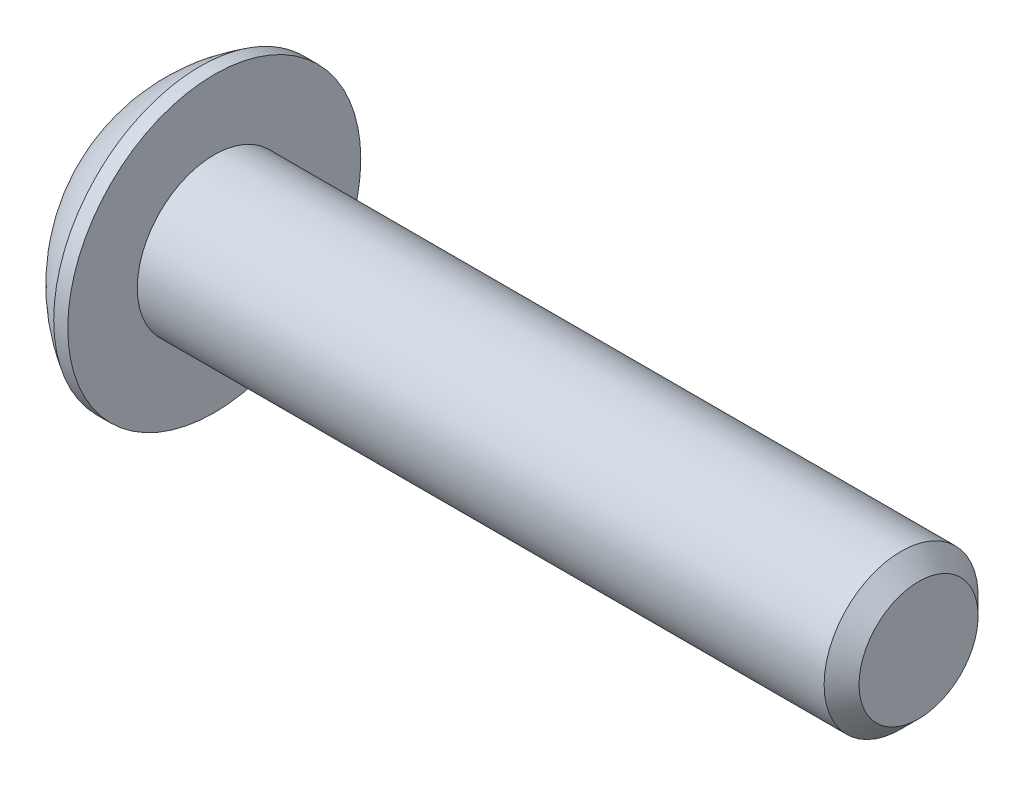
ISO-10303-21;
HEADER;
FILE_DESCRIPTION(('STEP AP214'),'2;1');
FILE_NAME('part.step','',(''),(''),'','','');
FILE_SCHEMA(('AUTOMOTIVE_DESIGN { 1 0 10303 214 1 1 1 1 }'));
ENDSEC;
DATA;
#1=APPLICATION_CONTEXT('core data for automotive mechanical design processes');
#2=APPLICATION_PROTOCOL_DEFINITION('international standard','automotive_design',2000,#1);
#3=PRODUCT_CONTEXT('',#1,'mechanical');
#4=PRODUCT('Part','Part','',(#3));
#5=PRODUCT_RELATED_PRODUCT_CATEGORY('part','',(#4));
#6=PRODUCT_DEFINITION_FORMATION('','',#4);
#7=PRODUCT_DEFINITION_CONTEXT('part definition',#1,'design');
#8=PRODUCT_DEFINITION('design','',#6,#7);
#9=PRODUCT_DEFINITION_SHAPE('','',#8);
#10=(LENGTH_UNIT() NAMED_UNIT(*) SI_UNIT(.MILLI.,.METRE.));
#11=(NAMED_UNIT(*) PLANE_ANGLE_UNIT() SI_UNIT($,.RADIAN.));
#12=(NAMED_UNIT(*) SI_UNIT($,.STERADIAN.) SOLID_ANGLE_UNIT());
#13=UNCERTAINTY_MEASURE_WITH_UNIT(LENGTH_MEASURE(1.E-05),#10,'distance_accuracy_value','');
#14=(GEOMETRIC_REPRESENTATION_CONTEXT(3) GLOBAL_UNCERTAINTY_ASSIGNED_CONTEXT((#13)) GLOBAL_UNIT_ASSIGNED_CONTEXT((#10,
#11,#12)) REPRESENTATION_CONTEXT('',''));
#15=CARTESIAN_POINT('',(0.,0.,0.));
#16=DIRECTION('',(0.,0.,1.));
#17=DIRECTION('',(1.,0.,0.));
#18=AXIS2_PLACEMENT_3D('',#15,#16,#17);
#19=CARTESIAN_POINT('',(1.32080000000034,0.,0.));
#20=DIRECTION('',(-1.,0.,0.));
#21=DIRECTION('',(0.,0.,1.));
#22=AXIS2_PLACEMENT_3D('',#19,#20,#21);
#23=CONICAL_SURFACE('',#22,1.1937999999998,1.04719755119608);
#24=CARTESIAN_POINT('',(2.01004075135902,0.,4.44089209850063E-13));
#25=VERTEX_POINT('',#24);
#26=VERTEX_LOOP('',#25);
#27=FACE_BOUND('',#26,.T.);
#28=CARTESIAN_POINT('',(1.32080000000009,0.,0.));
#29=DIRECTION('',(-1.,0.,0.));
#30=DIRECTION('',(0.,0.,1.));
#31=AXIS2_PLACEMENT_3D('',#28,#29,#30);
#32=CIRCLE('',#31,1.19380000000024);
#33=CARTESIAN_POINT('',(1.32080000000004,-1.03386112703797,0.59690000000006));
#34=VERTEX_POINT('',#33);
#35=CARTESIAN_POINT('',(1.32080000000004,0.,1.19380000000012));
#36=VERTEX_POINT('',#35);
#37=EDGE_CURVE('E19',#34,#36,#32,.T.);
#38=ORIENTED_EDGE('',*,*,#37,.T.);
#39=CARTESIAN_POINT('',(1.32080000000009,0.,0.));
#40=DIRECTION('',(-1.,0.,0.));
#41=DIRECTION('',(0.,0.,1.));
#42=AXIS2_PLACEMENT_3D('',#39,#40,#41);
#43=CIRCLE('',#42,1.19380000000024);
#44=CARTESIAN_POINT('',(1.32080000000004,1.03386112703797,0.596900000000061));
#45=VERTEX_POINT('',#44);
#46=EDGE_CURVE('E147',#36,#45,#43,.T.);
#47=ORIENTED_EDGE('',*,*,#46,.T.);
#48=CARTESIAN_POINT('',(1.32080000000009,0.,0.));
#49=DIRECTION('',(-1.,0.,0.));
#50=DIRECTION('',(0.,0.,1.));
#51=AXIS2_PLACEMENT_3D('',#48,#49,#50);
#52=CIRCLE('',#51,1.19380000000024);
#53=CARTESIAN_POINT('',(1.32080000000004,1.03386112703797,-0.596900000000061));
#54=VERTEX_POINT('',#53);
#55=EDGE_CURVE('E317',#45,#54,#52,.T.);
#56=ORIENTED_EDGE('',*,*,#55,.T.);
#57=CARTESIAN_POINT('',(1.32080000000009,0.,0.));
#58=DIRECTION('',(-1.,0.,0.));
#59=DIRECTION('',(0.,0.,1.));
#60=AXIS2_PLACEMENT_3D('',#57,#58,#59);
#61=CIRCLE('',#60,1.19380000000024);
#62=CARTESIAN_POINT('',(1.32080000000004,1.49457637585666E-12,-1.19380000000012));
#63=VERTEX_POINT('',#62);
#64=EDGE_CURVE('E318',#54,#63,#61,.T.);
#65=ORIENTED_EDGE('',*,*,#64,.T.);
#66=CARTESIAN_POINT('',(1.32080000000009,0.,0.));
#67=DIRECTION('',(-1.,0.,0.));
#68=DIRECTION('',(0.,0.,1.));
#69=AXIS2_PLACEMENT_3D('',#66,#67,#68);
#70=CIRCLE('',#69,1.19380000000024);
#71=CARTESIAN_POINT('',(1.32080000000004,-1.03386112703797,-0.59690000000006));
#72=VERTEX_POINT('',#71);
#73=EDGE_CURVE('E92',#63,#72,#70,.T.);
#74=ORIENTED_EDGE('',*,*,#73,.T.);
#75=CARTESIAN_POINT('',(1.32080000000009,0.,0.));
#76=DIRECTION('',(-1.,0.,0.));
#77=DIRECTION('',(0.,0.,1.));
#78=AXIS2_PLACEMENT_3D('',#75,#76,#77);
#79=CIRCLE('',#78,1.19380000000024);
#80=EDGE_CURVE('E88',#72,#34,#79,.T.);
#81=ORIENTED_EDGE('',*,*,#80,.T.);
#82=EDGE_LOOP('',(#38,#47,#56,#65,#74,#81));
#83=FACE_BOUND('',#82,.T.);
#84=ADVANCED_FACE('F16',(#27,#83),#23,.F.);
#85=CARTESIAN_POINT('',(1.3208,-2.06772225407572,-1.1938));
#86=DIRECTION('',(1.,0.,0.));
#87=DIRECTION('',(0.,0.,-1.));
#88=AXIS2_PLACEMENT_3D('',#85,#86,#87);
#89=PLANE('',#88);
#90=DIRECTION('',(0.,0.5,0.866025403784439));
#91=VECTOR('',#90,1.);
#92=CARTESIAN_POINT('',(1.3208,-1.37848150271715,0.));
#93=LINE('',#92,#91);
#94=CARTESIAN_POINT('',(1.3208,-0.689240751358574,1.1938));
#95=VERTEX_POINT('',#94);
#96=EDGE_CURVE('E100',#95,#34,#93,.F.);
#97=ORIENTED_EDGE('',*,*,#96,.F.);
#98=DIRECTION('',(0.,1.,0.));
#99=VECTOR('',#98,1.);
#100=CARTESIAN_POINT('',(1.3208,-0.689240751358574,1.1938));
#101=LINE('',#100,#99);
#102=EDGE_CURVE('E102',#36,#95,#101,.F.);
#103=ORIENTED_EDGE('',*,*,#102,.F.);
#104=ORIENTED_EDGE('',*,*,#37,.F.);
#105=EDGE_LOOP('',(#97,#103,#104));
#106=FACE_BOUND('',#105,.T.);
#107=ADVANCED_FACE('F98',(#106),#89,.F.);
#108=CARTESIAN_POINT('',(1.3208,-2.06772225407572,-1.1938));
#109=DIRECTION('',(1.,0.,0.));
#110=DIRECTION('',(0.,0.,-1.));
#111=AXIS2_PLACEMENT_3D('',#108,#109,#110);
#112=PLANE('',#111);
#113=DIRECTION('',(0.,-0.5,0.866025403784439));
#114=VECTOR('',#113,1.);
#115=CARTESIAN_POINT('',(1.3208,-0.689240751358574,-1.1938));
#116=LINE('',#115,#114);
#117=CARTESIAN_POINT('',(1.3208,-1.37848150271715,0.));
#118=VERTEX_POINT('',#117);
#119=EDGE_CURVE('E108',#118,#72,#116,.F.);
#120=ORIENTED_EDGE('',*,*,#119,.F.);
#121=DIRECTION('',(0.,0.5,0.866025403784439));
#122=VECTOR('',#121,1.);
#123=CARTESIAN_POINT('',(1.3208,-1.37848150271715,0.));
#124=LINE('',#123,#122);
#125=EDGE_CURVE('E105',#34,#118,#124,.F.);
#126=ORIENTED_EDGE('',*,*,#125,.F.);
#127=ORIENTED_EDGE('',*,*,#80,.F.);
#128=EDGE_LOOP('',(#120,#126,#127));
#129=FACE_BOUND('',#128,.T.);
#130=ADVANCED_FACE('F106',(#129),#112,.F.);
#131=CARTESIAN_POINT('',(1.3208,-2.06772225407572,-1.1938));
#132=DIRECTION('',(1.,0.,0.));
#133=DIRECTION('',(0.,0.,-1.));
#134=AXIS2_PLACEMENT_3D('',#131,#132,#133);
#135=PLANE('',#134);
#136=DIRECTION('',(0.,1.,0.));
#137=VECTOR('',#136,1.);
#138=CARTESIAN_POINT('',(1.3208,0.689240751358577,-1.1938));
#139=LINE('',#138,#137);
#140=CARTESIAN_POINT('',(1.3208,-0.689240751358574,-1.1938));
#141=VERTEX_POINT('',#140);
#142=EDGE_CURVE('E287',#141,#63,#139,.T.);
#143=ORIENTED_EDGE('',*,*,#142,.F.);
#144=DIRECTION('',(0.,-0.5,0.866025403784439));
#145=VECTOR('',#144,1.);
#146=CARTESIAN_POINT('',(1.3208,-0.689240751358574,-1.1938));
#147=LINE('',#146,#145);
#148=EDGE_CURVE('E299',#72,#141,#147,.F.);
#149=ORIENTED_EDGE('',*,*,#148,.F.);
#150=ORIENTED_EDGE('',*,*,#73,.F.);
#151=EDGE_LOOP('',(#143,#149,#150));
#152=FACE_BOUND('',#151,.T.);
#153=ADVANCED_FACE('F190',(#152),#135,.F.);
#154=CARTESIAN_POINT('',(1.3208,-2.06772225407572,-1.1938));
#155=DIRECTION('',(1.,0.,0.));
#156=DIRECTION('',(0.,0.,-1.));
#157=AXIS2_PLACEMENT_3D('',#154,#155,#156);
#158=PLANE('',#157);
#159=DIRECTION('',(0.,-0.5,-0.866025403784439));
#160=VECTOR('',#159,1.);
#161=CARTESIAN_POINT('',(1.3208,1.37848150271715,0.));
#162=LINE('',#161,#160);
#163=CARTESIAN_POINT('',(1.3208,0.689240751358577,-1.1938));
#164=VERTEX_POINT('',#163);
#165=EDGE_CURVE('E273',#164,#54,#162,.F.);
#166=ORIENTED_EDGE('',*,*,#165,.F.);
#167=DIRECTION('',(0.,1.,0.));
#168=VECTOR('',#167,1.);
#169=CARTESIAN_POINT('',(1.3208,0.689240751358577,-1.1938));
#170=LINE('',#169,#168);
#171=EDGE_CURVE('E284',#63,#164,#170,.T.);
#172=ORIENTED_EDGE('',*,*,#171,.F.);
#173=ORIENTED_EDGE('',*,*,#64,.F.);
#174=EDGE_LOOP('',(#166,#172,#173));
#175=FACE_BOUND('',#174,.T.);
#176=ADVANCED_FACE('F186',(#175),#158,.F.);
#177=CARTESIAN_POINT('',(1.3208,-2.06772225407572,-1.1938));
#178=DIRECTION('',(1.,0.,0.));
#179=DIRECTION('',(0.,0.,-1.));
#180=AXIS2_PLACEMENT_3D('',#177,#178,#179);
#181=PLANE('',#180);
#182=DIRECTION('',(0.,0.5,-0.866025403784439));
#183=VECTOR('',#182,1.);
#184=CARTESIAN_POINT('',(1.3208,0.689240751358576,1.1938));
#185=LINE('',#184,#183);
#186=CARTESIAN_POINT('',(1.3208,1.37848150271715,0.));
#187=VERTEX_POINT('',#186);
#188=EDGE_CURVE('E252',#187,#45,#185,.F.);
#189=ORIENTED_EDGE('',*,*,#188,.F.);
#190=DIRECTION('',(0.,-0.5,-0.866025403784439));
#191=VECTOR('',#190,1.);
#192=CARTESIAN_POINT('',(1.3208,1.37848150271715,0.));
#193=LINE('',#192,#191);
#194=EDGE_CURVE('E271',#54,#187,#193,.F.);
#195=ORIENTED_EDGE('',*,*,#194,.F.);
#196=ORIENTED_EDGE('',*,*,#55,.F.);
#197=EDGE_LOOP('',(#189,#195,#196));
#198=FACE_BOUND('',#197,.T.);
#199=ADVANCED_FACE('F182',(#198),#181,.F.);
#200=CARTESIAN_POINT('',(1.3208,-2.06772225407572,-1.1938));
#201=DIRECTION('',(1.,0.,0.));
#202=DIRECTION('',(0.,0.,-1.));
#203=AXIS2_PLACEMENT_3D('',#200,#201,#202);
#204=PLANE('',#203);
#205=DIRECTION('',(0.,1.,0.));
#206=VECTOR('',#205,1.);
#207=CARTESIAN_POINT('',(1.3208,-0.689240751358574,1.1938));
#208=LINE('',#207,#206);
#209=CARTESIAN_POINT('',(1.3208,0.689240751358576,1.1938));
#210=VERTEX_POINT('',#209);
#211=EDGE_CURVE('E117',#210,#36,#208,.F.);
#212=ORIENTED_EDGE('',*,*,#211,.F.);
#213=DIRECTION('',(0.,0.5,-0.866025403784439));
#214=VECTOR('',#213,1.);
#215=CARTESIAN_POINT('',(1.3208,0.689240751358576,1.1938));
#216=LINE('',#215,#214);
#217=EDGE_CURVE('E255',#45,#210,#216,.F.);
#218=ORIENTED_EDGE('',*,*,#217,.F.);
#219=ORIENTED_EDGE('',*,*,#46,.F.);
#220=EDGE_LOOP('',(#212,#218,#219));
#221=FACE_BOUND('',#220,.T.);
#222=ADVANCED_FACE('F178',(#221),#204,.F.);
#223=CARTESIAN_POINT('',(1.3208,-0.689240751358574,1.1938));
#224=DIRECTION('',(0.,0.,-1.));
#225=DIRECTION('',(0.,1.,0.));
#226=AXIS2_PLACEMENT_3D('',#223,#224,#225);
#227=PLANE('',#226);
#228=DIRECTION('',(0.,1.,0.));
#229=VECTOR('',#228,1.);
#230=CARTESIAN_POINT('',(0.,0.,1.1938));
#231=LINE('',#230,#229);
#232=CARTESIAN_POINT('',(0.,0.689240751358577,1.1938));
#233=VERTEX_POINT('',#232);
#234=CARTESIAN_POINT('',(0.,-0.689240751358574,1.1938));
#235=VERTEX_POINT('',#234);
#236=EDGE_CURVE('E249',#233,#235,#231,.F.);
#237=ORIENTED_EDGE('',*,*,#236,.F.);
#238=DIRECTION('',(1.,0.,0.));
#239=VECTOR('',#238,1.);
#240=CARTESIAN_POINT('',(1.3208,0.689240751358576,1.1938));
#241=LINE('',#240,#239);
#242=EDGE_CURVE('E261',#210,#233,#241,.F.);
#243=ORIENTED_EDGE('',*,*,#242,.F.);
#244=ORIENTED_EDGE('',*,*,#211,.T.);
#245=ORIENTED_EDGE('',*,*,#102,.T.);
#246=DIRECTION('',(1.,0.,0.));
#247=VECTOR('',#246,1.);
#248=CARTESIAN_POINT('',(1.3208,-0.689240751358574,1.1938));
#249=LINE('',#248,#247);
#250=EDGE_CURVE('E111',#235,#95,#249,.T.);
#251=ORIENTED_EDGE('',*,*,#250,.F.);
#252=EDGE_LOOP('',(#237,#243,#244,#245,#251));
#253=FACE_BOUND('',#252,.T.);
#254=ADVANCED_FACE('F175',(#253),#227,.T.);
#255=CARTESIAN_POINT('',(1.3208,-1.37848150271715,0.));
#256=DIRECTION('',(0.,0.866025403784439,-0.5));
#257=DIRECTION('',(0.,0.5,0.866025403784439));
#258=AXIS2_PLACEMENT_3D('',#255,#256,#257);
#259=PLANE('',#258);
#260=DIRECTION('',(0.,-0.5,-0.866025403784439));
#261=VECTOR('',#260,1.);
#262=CARTESIAN_POINT('',(0.,-0.689240751358574,1.1938));
#263=LINE('',#262,#261);
#264=CARTESIAN_POINT('',(0.,-1.37848150271715,0.));
#265=VERTEX_POINT('',#264);
#266=EDGE_CURVE('E246',#235,#265,#263,.T.);
#267=ORIENTED_EDGE('',*,*,#266,.F.);
#268=ORIENTED_EDGE('',*,*,#250,.T.);
#269=ORIENTED_EDGE('',*,*,#96,.T.);
#270=ORIENTED_EDGE('',*,*,#125,.T.);
#271=DIRECTION('',(1.,0.,0.));
#272=VECTOR('',#271,1.);
#273=CARTESIAN_POINT('',(1.3208,-1.37848150271715,0.));
#274=LINE('',#273,#272);
#275=EDGE_CURVE('E296',#265,#118,#274,.T.);
#276=ORIENTED_EDGE('',*,*,#275,.F.);
#277=EDGE_LOOP('',(#267,#268,#269,#270,#276));
#278=FACE_BOUND('',#277,.T.);
#279=ADVANCED_FACE('F115',(#278),#259,.T.);
#280=CARTESIAN_POINT('',(1.3208,-0.689240751358574,-1.1938));
#281=DIRECTION('',(0.,0.866025403784439,0.5));
#282=DIRECTION('',(0.,-0.5,0.866025403784439));
#283=AXIS2_PLACEMENT_3D('',#280,#281,#282);
#284=PLANE('',#283);
#285=DIRECTION('',(0.,0.5,-0.866025403784439));
#286=VECTOR('',#285,1.);
#287=CARTESIAN_POINT('',(0.,-1.37848150271715,0.));
#288=LINE('',#287,#286);
#289=CARTESIAN_POINT('',(0.,-0.689240751358574,-1.1938));
#290=VERTEX_POINT('',#289);
#291=EDGE_CURVE('E243',#265,#290,#288,.T.);
#292=ORIENTED_EDGE('',*,*,#291,.F.);
#293=ORIENTED_EDGE('',*,*,#275,.T.);
#294=ORIENTED_EDGE('',*,*,#119,.T.);
#295=ORIENTED_EDGE('',*,*,#148,.T.);
#296=DIRECTION('',(1.,0.,0.));
#297=VECTOR('',#296,1.);
#298=CARTESIAN_POINT('',(1.3208,-0.689240751358574,-1.1938));
#299=LINE('',#298,#297);
#300=EDGE_CURVE('E281',#290,#141,#299,.T.);
#301=ORIENTED_EDGE('',*,*,#300,.F.);
#302=EDGE_LOOP('',(#292,#293,#294,#295,#301));
#303=FACE_BOUND('',#302,.T.);
#304=ADVANCED_FACE('F168',(#303),#284,.T.);
#305=CARTESIAN_POINT('',(1.3208,0.689240751358577,-1.1938));
#306=DIRECTION('',(0.,0.,1.));
#307=DIRECTION('',(1.,0.,0.));
#308=AXIS2_PLACEMENT_3D('',#305,#306,#307);
#309=PLANE('',#308);
#310=DIRECTION('',(0.,1.,0.));
#311=VECTOR('',#310,1.);
#312=CARTESIAN_POINT('',(0.,0.,-1.1938));
#313=LINE('',#312,#311);
#314=CARTESIAN_POINT('',(0.,0.689240751358577,-1.1938));
#315=VERTEX_POINT('',#314);
#316=EDGE_CURVE('E240',#290,#315,#313,.T.);
#317=ORIENTED_EDGE('',*,*,#316,.F.);
#318=ORIENTED_EDGE('',*,*,#300,.T.);
#319=ORIENTED_EDGE('',*,*,#142,.T.);
#320=ORIENTED_EDGE('',*,*,#171,.T.);
#321=DIRECTION('',(1.,0.,0.));
#322=VECTOR('',#321,1.);
#323=CARTESIAN_POINT('',(1.3208,0.689240751358577,-1.1938));
#324=LINE('',#323,#322);
#325=EDGE_CURVE('E256',#315,#164,#324,.T.);
#326=ORIENTED_EDGE('',*,*,#325,.F.);
#327=EDGE_LOOP('',(#317,#318,#319,#320,#326));
#328=FACE_BOUND('',#327,.T.);
#329=ADVANCED_FACE('F165',(#328),#309,.T.);
#330=CARTESIAN_POINT('',(1.3208,1.37848150271715,0.));
#331=DIRECTION('',(0.,-0.866025403784439,0.5));
#332=DIRECTION('',(0.,-0.5,-0.866025403784439));
#333=AXIS2_PLACEMENT_3D('',#330,#331,#332);
#334=PLANE('',#333);
#335=DIRECTION('',(0.,0.5,0.866025403784439));
#336=VECTOR('',#335,1.);
#337=CARTESIAN_POINT('',(0.,0.689240751358577,-1.1938));
#338=LINE('',#337,#336);
#339=CARTESIAN_POINT('',(0.,1.37848150271715,0.));
#340=VERTEX_POINT('',#339);
#341=EDGE_CURVE('E237',#315,#340,#338,.T.);
#342=ORIENTED_EDGE('',*,*,#341,.F.);
#343=ORIENTED_EDGE('',*,*,#325,.T.);
#344=ORIENTED_EDGE('',*,*,#165,.T.);
#345=ORIENTED_EDGE('',*,*,#194,.T.);
#346=DIRECTION('',(1.,0.,0.));
#347=VECTOR('',#346,1.);
#348=CARTESIAN_POINT('',(1.3208,1.37848150271715,0.));
#349=LINE('',#348,#347);
#350=EDGE_CURVE('E34',#340,#187,#349,.T.);
#351=ORIENTED_EDGE('',*,*,#350,.F.);
#352=EDGE_LOOP('',(#342,#343,#344,#345,#351));
#353=FACE_BOUND('',#352,.T.);
#354=ADVANCED_FACE('F161',(#353),#334,.T.);
#355=CARTESIAN_POINT('',(1.3208,0.689240751358576,1.1938));
#356=DIRECTION('',(0.,-0.866025403784439,-0.5));
#357=DIRECTION('',(0.,0.5,-0.866025403784439));
#358=AXIS2_PLACEMENT_3D('',#355,#356,#357);
#359=PLANE('',#358);
#360=DIRECTION('',(0.,-0.5,0.866025403784439));
#361=VECTOR('',#360,1.);
#362=CARTESIAN_POINT('',(0.,1.37848150271715,0.));
#363=LINE('',#362,#361);
#364=EDGE_CURVE('E146',#340,#233,#363,.T.);
#365=ORIENTED_EDGE('',*,*,#364,.F.);
#366=ORIENTED_EDGE('',*,*,#350,.T.);
#367=ORIENTED_EDGE('',*,*,#188,.T.);
#368=ORIENTED_EDGE('',*,*,#217,.T.);
#369=ORIENTED_EDGE('',*,*,#242,.T.);
#370=EDGE_LOOP('',(#365,#366,#367,#368,#369));
#371=FACE_BOUND('',#370,.T.);
#372=ADVANCED_FACE('F157',(#371),#359,.T.);
#373=CARTESIAN_POINT('',(0.,0.,0.));
#374=DIRECTION('',(-1.,0.,0.));
#375=DIRECTION('',(0.,0.,1.));
#376=AXIS2_PLACEMENT_3D('',#373,#374,#375);
#377=PLANE('',#376);
#378=ORIENTED_EDGE('',*,*,#341,.T.);
#379=ORIENTED_EDGE('',*,*,#364,.T.);
#380=ORIENTED_EDGE('',*,*,#236,.T.);
#381=ORIENTED_EDGE('',*,*,#266,.T.);
#382=ORIENTED_EDGE('',*,*,#291,.T.);
#383=ORIENTED_EDGE('',*,*,#316,.T.);
#384=EDGE_LOOP('',(#378,#379,#380,#381,#382,#383));
#385=FACE_BOUND('',#384,.T.);
#386=CARTESIAN_POINT('',(0.,1.9812,0.));
#387=CARTESIAN_POINT('',(0.,1.9811996664299,0.0556258831179428));
#388=CARTESIAN_POINT('',(0.,1.97885520380442,0.111261989398606));
#389=CARTESIAN_POINT('',(0.,1.96949260169541,0.222149719830458));
#390=CARTESIAN_POINT('',(0.,1.96247308239605,0.277401225602895));
#391=CARTESIAN_POINT('',(0.,1.94379192841038,0.387209508139747));
#392=CARTESIAN_POINT('',(-1.85325793235264E-13,1.93212292489526,0.441765039546365));
#393=CARTESIAN_POINT('',(1.86344214223505E-13,1.90422331175315,0.549729449347493));
#394=CARTESIAN_POINT('',(6.94543371897454E-13,1.88798900035338,0.603137359208869));
#395=CARTESIAN_POINT('',(1.15501975216981E-12,1.83266214476501,0.760839131321828));
#396=CARTESIAN_POINT('',(0.,1.78690023648845,0.862876433575429));
#397=CARTESIAN_POINT('',(0.,1.67887358150667,1.05780719540872));
#398=CARTESIAN_POINT('',(9.54193214892627E-13,1.6166082074585,1.15070030720801));
#399=CARTESIAN_POINT('',(5.94805591894675E-13,1.51224157140982,1.28116890915697));
#400=CARTESIAN_POINT('',(1.63221293851378E-13,1.4755970394354,1.32320451127026));
#401=CARTESIAN_POINT('',(-1.62196980336157E-13,1.39893832619713,1.40400288695709));
#402=CARTESIAN_POINT('',(0.,1.35892742784698,1.44276877695455));
#403=CARTESIAN_POINT('',(1.14362537325405E-13,1.23416504602197,1.55382272417904));
#404=CARTESIAN_POINT('',(0.,1.14466125559859,1.62089527952111));
#405=CARTESIAN_POINT('',(0.,0.955712144178167,1.7390221808118));
#406=CARTESIAN_POINT('',(0.,0.856267198233564,1.79007713076007));
#407=CARTESIAN_POINT('',(0.,0.650206345910843,1.87477637530954));
#408=CARTESIAN_POINT('',(0.,0.543590516134855,1.90842085586267));
#409=CARTESIAN_POINT('',(0.,0.326226155292018,1.95733039300656));
#410=CARTESIAN_POINT('',(0.,0.21547760215793,1.97259535144288));
#411=CARTESIAN_POINT('',(0.,-0.00701040587544639,1.98431697865418));
#412=CARTESIAN_POINT('',(0.,-0.118749860774734,1.98077364742917));
#413=CARTESIAN_POINT('',(0.,-0.340050178355485,1.95497485623825));
#414=CARTESIAN_POINT('',(0.,-0.449611052668255,1.93271949620218));
#415=CARTESIAN_POINT('',(0.,-0.663431110729174,1.87014138774523));
#416=CARTESIAN_POINT('',(0.,-0.76769023783852,1.82981844635272));
#417=CARTESIAN_POINT('',(0.,-0.968005760719347,1.73219968377096));
#418=CARTESIAN_POINT('',(0.,-1.0640618469811,1.6749032225164));
#419=CARTESIAN_POINT('',(0.,-1.19980276751283,1.57757371205873));
#420=CARTESIAN_POINT('',(0.,-1.24366557129213,1.54322665019466));
#421=CARTESIAN_POINT('',(0.,-1.32838995706696,1.47093063174264));
#422=CARTESIAN_POINT('',(0.,-1.36924860178706,1.43297823102439));
#423=CARTESIAN_POINT('',(0.,-1.48674671849223,1.31419842051173));
#424=CARTESIAN_POINT('',(0.,-1.55842832343237,1.22836221289311));
#425=CARTESIAN_POINT('',(0.,-1.6863396856475,1.04586168272493));
#426=CARTESIAN_POINT('',(0.,-1.7425700302488,0.949197771949774));
#427=CARTESIAN_POINT('',(0.,-1.8141614250401,0.798182600298684));
#428=CARTESIAN_POINT('',(0.,-1.83591780585875,0.746776203847791));
#429=CARTESIAN_POINT('',(0.,-1.87500754181092,0.642341081688636));
#430=CARTESIAN_POINT('',(0.,-1.89234447645404,0.589313708122847));
#431=CARTESIAN_POINT('',(0.,-1.92246053433554,0.482076273028395));
#432=CARTESIAN_POINT('',(0.,-1.93524685475118,0.42786822425751));
#433=CARTESIAN_POINT('',(0.,-1.95620937250494,0.318578151844611));
#434=CARTESIAN_POINT('',(0.,-1.96438692958147,0.263496390912872));
#435=CARTESIAN_POINT('',(0.,-1.97388528284653,0.173607715038558));
#436=CARTESIAN_POINT('',(0.,-1.97662743364426,0.138944718024998));
#437=CARTESIAN_POINT('',(0.,-1.98028489645283,0.0695224782567002));
#438=CARTESIAN_POINT('',(0.,-1.98120020846367,0.0347632355019631));
#439=CARTESIAN_POINT('',(0.,-1.9811996664299,-0.0556258831179437));
#440=CARTESIAN_POINT('',(0.,-1.97885520380442,-0.111261989398607));
#441=CARTESIAN_POINT('',(0.,-1.96949260169541,-0.222149719830459));
#442=CARTESIAN_POINT('',(0.,-1.96247308239605,-0.277401225602897));
#443=CARTESIAN_POINT('',(0.,-1.94379192841039,-0.387209508139749));
#444=CARTESIAN_POINT('',(-1.85269749640691E-13,-1.93212292489526,-0.441765039546367));
#445=CARTESIAN_POINT('',(1.86288125054388E-13,-1.90422331175315,-0.549729449347495));
#446=CARTESIAN_POINT('',(6.94525090263764E-13,-1.88798900035338,-0.603137359208872));
#447=CARTESIAN_POINT('',(1.15505622829081E-12,-1.83266214476501,-0.760839131321831));
#448=CARTESIAN_POINT('',(0.,-1.78690023648845,-0.862876433575431));
#449=CARTESIAN_POINT('',(0.,-1.67887358150667,-1.05780719540872));
#450=CARTESIAN_POINT('',(9.54248812869379E-13,-1.6166082074585,-1.15070030720801));
#451=CARTESIAN_POINT('',(5.94777756479239E-13,-1.51224157140982,-1.28116890915698));
#452=CARTESIAN_POINT('',(1.63138949183833E-13,-1.47559703943539,-1.32320451127027));
#453=CARTESIAN_POINT('',(-1.62114715061273E-13,-1.39893832619713,-1.40400288695709));
#454=CARTESIAN_POINT('',(0.,-1.35892742784699,-1.44276877695455));
#455=CARTESIAN_POINT('',(1.13760489124207E-13,-1.23416504602197,-1.55382272417904));
#456=CARTESIAN_POINT('',(0.,-1.14466125559859,-1.62089527952111));
#457=CARTESIAN_POINT('',(0.,-0.95571214417816,-1.73902218081179));
#458=CARTESIAN_POINT('',(0.,-0.856267198233559,-1.79007713076007));
#459=CARTESIAN_POINT('',(0.,-0.650206345910841,-1.87477637530954));
#460=CARTESIAN_POINT('',(0.,-0.543590516134854,-1.90842085586267));
#461=CARTESIAN_POINT('',(0.,-0.326226155292018,-1.95733039300657));
#462=CARTESIAN_POINT('',(0.,-0.215477602157929,-1.97259535144288));
#463=CARTESIAN_POINT('',(0.,0.0070104058754487,-1.98431697865418));
#464=CARTESIAN_POINT('',(0.,0.118749860774737,-1.98077364742916));
#465=CARTESIAN_POINT('',(0.,0.340050178355489,-1.95497485623824));
#466=CARTESIAN_POINT('',(0.,0.44961105266826,-1.93271949620218));
#467=CARTESIAN_POINT('',(0.,0.663431110729178,-1.87014138774524));
#468=CARTESIAN_POINT('',(0.,0.767690237838524,-1.82981844635272));
#469=CARTESIAN_POINT('',(0.,0.968005760719348,-1.73219968377096));
#470=CARTESIAN_POINT('',(0.,1.0640618469811,-1.67490322251639));
#471=CARTESIAN_POINT('',(0.,1.19980276751283,-1.57757371205873));
#472=CARTESIAN_POINT('',(0.,1.24366557129214,-1.54322665019465));
#473=CARTESIAN_POINT('',(0.,1.32838995706696,-1.47093063174263));
#474=CARTESIAN_POINT('',(0.,1.36924860178706,-1.43297823102439));
#475=CARTESIAN_POINT('',(0.,1.48674671849223,-1.31419842051172));
#476=CARTESIAN_POINT('',(0.,1.55842832343237,-1.22836221289311));
#477=CARTESIAN_POINT('',(0.,1.6863396856475,-1.04586168272492));
#478=CARTESIAN_POINT('',(0.,1.7425700302488,-0.949197771949768));
#479=CARTESIAN_POINT('',(0.,1.8141614250401,-0.798182600298677));
#480=CARTESIAN_POINT('',(0.,1.83591780585875,-0.746776203847785));
#481=CARTESIAN_POINT('',(0.,1.87500754181092,-0.64234108168863));
#482=CARTESIAN_POINT('',(0.,1.89234447645404,-0.589313708122841));
#483=CARTESIAN_POINT('',(0.,1.92246053433555,-0.482076273028389));
#484=CARTESIAN_POINT('',(0.,1.93524685475118,-0.427868224257505));
#485=CARTESIAN_POINT('',(0.,1.95620937250494,-0.318578151844605));
#486=CARTESIAN_POINT('',(0.,1.96438692958147,-0.263496390912866));
#487=CARTESIAN_POINT('',(0.,1.97388528284653,-0.173607715038553));
#488=CARTESIAN_POINT('',(0.,1.97662743364426,-0.138944718024994));
#489=CARTESIAN_POINT('',(0.,1.98028489645283,-0.0695224782566989));
#490=CARTESIAN_POINT('',(0.,1.98120020846367,-0.034763235501963));
#491=CARTESIAN_POINT('',(0.,1.9812,0.));
#492=B_SPLINE_CURVE_WITH_KNOTS('',3,(#386,#387,#388,#389,#390,#391,#392,#393,#394,#395,#396,
#397,#398,#399,#400,#401,#402,#403,#404,#405,#406,#407,#408,#409,#410,#411,#412,#413,#414,#415,
#416,#417,#418,#419,#420,#421,#422,#423,#424,#425,#426,#427,#428,#429,#430,#431,#432,#433,#434,
#435,#436,#437,#438,#439,#440,#441,#442,#443,#444,#445,#446,#447,#448,#449,#450,#451,#452,#453,
#454,#455,#456,#457,#458,#459,#460,#461,#462,#463,#464,#465,#466,#467,#468,#469,#470,#471,#472,
#473,#474,#475,#476,#477,#478,#479,#480,#481,#482,#483,#484,#485,#486,#487,#488,#489,#490,#491),
.UNSPECIFIED.,.T.,.F.,(4,2,2,2,2,2,2,2,2,2,2,2,2,2,2,2,2,2,2,2,2,2,2,2,2,2,2,2,2,2,2,2,2,2,2,2,
2,2,2,2,2,2,2,2,2,2,2,2,2,2,2,2,4),(0.,0.166845646007828,0.333740557374255,0.500901034367693,
0.668197445942386,1.00199278686282,1.33580081809885,1.50292354032982,1.6698851310853,
2.00370118900129,2.33750465770544,2.67130456115909,3.005106247238,3.33890793331696,
3.67270783677065,4.00651130547476,4.34032736339026,4.50728895414554,4.67441167637632,
5.00821970761259,5.34201504853332,5.50931146010827,5.67647193710191,5.84336684846844,
6.0102124944764,6.11448220058334,6.21875190669029,6.38559755269812,6.55249246406454,
6.71965294105798,6.88694935263268,7.22074469355311,7.55455272478915,7.72167544702011,
7.88863703777559,8.22245309569158,8.55625656439573,8.89005646784938,9.2238581539283,
9.55765984000725,9.89145974346094,10.2252632121651,10.5590792700806,10.7260408608358,
10.8931635830666,11.2269716143029,11.5607669552236,11.7280633667986,11.8952238437922,
12.0621187551587,12.2289644011667,12.3332341072736,12.4375038133806),.UNSPECIFIED.);
#493=CARTESIAN_POINT('',(0.,1.9812,0.));
#494=VERTEX_POINT('',#493);
#495=EDGE_CURVE('E139',#494,#494,#492,.T.);
#496=ORIENTED_EDGE('',*,*,#495,.F.);
#497=EDGE_LOOP('',(#496));
#498=FACE_BOUND('',#497,.T.);
#499=ADVANCED_FACE('F153',(#385,#498),#377,.T.);
#500=CARTESIAN_POINT('',(4.13385,0.,0.));
#501=DIRECTION('',(0.,1.,0.));
#502=DIRECTION('',(1.,0.,0.));
#503=AXIS2_PLACEMENT_3D('',#500,#501,#502);
#504=SPHERICAL_SURFACE('',#503,4.58408870578439);
#505=CARTESIAN_POINT('',(1.8288,0.,0.));
#506=DIRECTION('',(-1.,0.,0.));
#507=DIRECTION('',(0.,0.,1.));
#508=AXIS2_PLACEMENT_3D('',#505,#506,#507);
#509=CIRCLE('',#508,3.9624);
#510=CARTESIAN_POINT('',(1.8288,0.,3.9624));
#511=VERTEX_POINT('',#510);
#512=EDGE_CURVE('E136',#511,#511,#509,.F.);
#513=ORIENTED_EDGE('',*,*,#512,.F.);
#514=EDGE_LOOP('',(#513));
#515=FACE_BOUND('',#514,.T.);
#516=ORIENTED_EDGE('',*,*,#495,.T.);
#517=EDGE_LOOP('',(#516));
#518=FACE_BOUND('',#517,.T.);
#519=ADVANCED_FACE('F149',(#515,#518),#504,.T.);
#520=CARTESIAN_POINT('',(21.2598,0.,0.));
#521=DIRECTION('',(-1.,0.,0.));
#522=DIRECTION('',(0.,0.,1.));
#523=AXIS2_PLACEMENT_3D('',#520,#521,#522);
#524=PLANE('',#523);
#525=CARTESIAN_POINT('',(21.2597999999389,0.,0.));
#526=DIRECTION('',(-1.,0.,0.));
#527=DIRECTION('',(0.,0.,1.));
#528=AXIS2_PLACEMENT_3D('',#525,#526,#527);
#529=CIRCLE('',#528,1.61036000002923);
#530=CARTESIAN_POINT('',(21.2597999999389,0.,1.61036000002923));
#531=VERTEX_POINT('',#530);
#532=EDGE_CURVE('E133',#531,#531,#529,.T.);
#533=ORIENTED_EDGE('',*,*,#532,.F.);
#534=EDGE_LOOP('',(#533));
#535=FACE_BOUND('',#534,.T.);
#536=ADVANCED_FACE('F221',(#535),#524,.F.);
#537=CARTESIAN_POINT('',(0.,0.,0.));
#538=DIRECTION('',(-1.,0.,0.));
#539=DIRECTION('',(0.,0.,1.));
#540=AXIS2_PLACEMENT_3D('',#537,#538,#539);
#541=CYLINDRICAL_SURFACE('',#540,3.9624);
#542=ORIENTED_EDGE('',*,*,#512,.T.);
#543=EDGE_LOOP('',(#542));
#544=FACE_BOUND('',#543,.T.);
#545=CARTESIAN_POINT('',(2.2098,0.,0.));
#546=DIRECTION('',(-1.,0.,0.));
#547=DIRECTION('',(0.,0.,1.));
#548=AXIS2_PLACEMENT_3D('',#545,#546,#547);
#549=CIRCLE('',#548,3.9624);
#550=CARTESIAN_POINT('',(2.2098,0.,3.9624));
#551=VERTEX_POINT('',#550);
#552=EDGE_CURVE('E130',#551,#551,#549,.T.);
#553=ORIENTED_EDGE('',*,*,#552,.T.);
#554=EDGE_LOOP('',(#553));
#555=FACE_BOUND('',#554,.T.);
#556=ADVANCED_FACE('F218',(#544,#555),#541,.T.);
#557=CARTESIAN_POINT('',(20.7873600000426,0.,0.));
#558=DIRECTION('',(-1.,0.,0.));
#559=DIRECTION('',(0.,0.,1.));
#560=AXIS2_PLACEMENT_3D('',#557,#558,#559);
#561=CONICAL_SURFACE('',#560,2.08279999992556,0.785398163397448);
#562=ORIENTED_EDGE('',*,*,#532,.T.);
#563=EDGE_LOOP('',(#562));
#564=FACE_BOUND('',#563,.T.);
#565=CARTESIAN_POINT('',(20.78736,0.,0.));
#566=DIRECTION('',(-1.,0.,0.));
#567=DIRECTION('',(0.,0.,1.));
#568=AXIS2_PLACEMENT_3D('',#565,#566,#567);
#569=CIRCLE('',#568,2.0828);
#570=CARTESIAN_POINT('',(20.78736,0.,2.0828));
#571=VERTEX_POINT('',#570);
#572=EDGE_CURVE('E25',#571,#571,#569,.T.);
#573=ORIENTED_EDGE('',*,*,#572,.F.);
#574=EDGE_LOOP('',(#573));
#575=FACE_BOUND('',#574,.T.);
#576=ADVANCED_FACE('F210',(#564,#575),#561,.T.);
#577=CARTESIAN_POINT('',(2.2098,2.0828,0.));
#578=DIRECTION('',(-1.,0.,0.));
#579=DIRECTION('',(0.,0.,1.));
#580=AXIS2_PLACEMENT_3D('',#577,#578,#579);
#581=PLANE('',#580);
#582=CARTESIAN_POINT('',(2.2098,0.,0.));
#583=DIRECTION('',(-1.,0.,0.));
#584=DIRECTION('',(0.,0.,1.));
#585=AXIS2_PLACEMENT_3D('',#582,#583,#584);
#586=CIRCLE('',#585,2.0828);
#587=CARTESIAN_POINT('',(2.2098,0.,2.0828));
#588=VERTEX_POINT('',#587);
#589=EDGE_CURVE('E10',#588,#588,#586,.F.);
#590=ORIENTED_EDGE('',*,*,#589,.F.);
#591=EDGE_LOOP('',(#590));
#592=FACE_BOUND('',#591,.T.);
#593=ORIENTED_EDGE('',*,*,#552,.F.);
#594=EDGE_LOOP('',(#593));
#595=FACE_BOUND('',#594,.T.);
#596=ADVANCED_FACE('F204',(#592,#595),#581,.F.);
#597=CARTESIAN_POINT('',(0.,0.,0.));
#598=DIRECTION('',(-1.,0.,0.));
#599=DIRECTION('',(0.,0.,1.));
#600=AXIS2_PLACEMENT_3D('',#597,#598,#599);
#601=CYLINDRICAL_SURFACE('',#600,2.0828);
#602=ORIENTED_EDGE('',*,*,#572,.T.);
#603=EDGE_LOOP('',(#602));
#604=FACE_BOUND('',#603,.T.);
#605=ORIENTED_EDGE('',*,*,#589,.T.);
#606=EDGE_LOOP('',(#605));
#607=FACE_BOUND('',#606,.T.);
#608=ADVANCED_FACE('F202',(#604,#607),#601,.T.);
#609=CLOSED_SHELL('',(#84,#107,#130,#153,#176,#199,#222,#254,#279,#304,#329,#354,#372,#499,#519,
#536,#556,#576,#596,#608));
#610=MANIFOLD_SOLID_BREP('B1',#609);
#611=ADVANCED_BREP_SHAPE_REPRESENTATION('',(#18,#610),#14);
#612=SHAPE_DEFINITION_REPRESENTATION(#9,#611);
ENDSEC;
END-ISO-10303-21;
